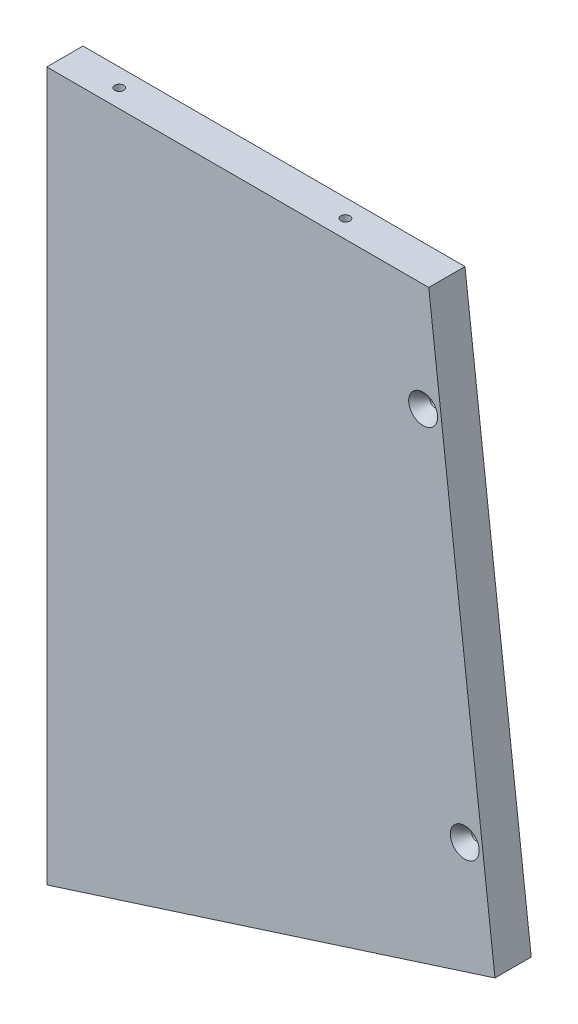
ISO-10303-21;
HEADER;
FILE_DESCRIPTION(('STEP AP214'),'2;1');
FILE_NAME('part.step','',(''),(''),'','','');
FILE_SCHEMA(('AUTOMOTIVE_DESIGN { 1 0 10303 214 1 1 1 1 }'));
ENDSEC;
DATA;
#1=APPLICATION_CONTEXT('core data for automotive mechanical design processes');
#2=APPLICATION_PROTOCOL_DEFINITION('international standard','automotive_design',2000,#1);
#3=PRODUCT_CONTEXT('',#1,'mechanical');
#4=PRODUCT('Part','Part','',(#3));
#5=PRODUCT_RELATED_PRODUCT_CATEGORY('part','',(#4));
#6=PRODUCT_DEFINITION_FORMATION('','',#4);
#7=PRODUCT_DEFINITION_CONTEXT('part definition',#1,'design');
#8=PRODUCT_DEFINITION('design','',#6,#7);
#9=PRODUCT_DEFINITION_SHAPE('','',#8);
#10=(LENGTH_UNIT() NAMED_UNIT(*) SI_UNIT(.MILLI.,.METRE.));
#11=(NAMED_UNIT(*) PLANE_ANGLE_UNIT() SI_UNIT($,.RADIAN.));
#12=(NAMED_UNIT(*) SI_UNIT($,.STERADIAN.) SOLID_ANGLE_UNIT());
#13=UNCERTAINTY_MEASURE_WITH_UNIT(LENGTH_MEASURE(1.E-05),#10,'distance_accuracy_value','');
#14=(GEOMETRIC_REPRESENTATION_CONTEXT(3) GLOBAL_UNCERTAINTY_ASSIGNED_CONTEXT((#13)) GLOBAL_UNIT_ASSIGNED_CONTEXT((#10,
#11,#12)) REPRESENTATION_CONTEXT('',''));
#15=CARTESIAN_POINT('',(0.,0.,0.));
#16=DIRECTION('',(0.,0.,1.));
#17=DIRECTION('',(1.,0.,0.));
#18=AXIS2_PLACEMENT_3D('',#15,#16,#17);
#19=CARTESIAN_POINT('',(-64.9774169834746,-197.96604829264,-12.6999999999997));
#20=DIRECTION('',(0.993195579602869,0.11645832154604,0.));
#21=DIRECTION('',(-0.11645832154604,0.993195579602869,0.));
#22=AXIS2_PLACEMENT_3D('',#19,#20,#21);
#23=PLANE('',#22);
#24=DIRECTION('',(-0.11645832154604,0.993195579602869,0.));
#25=VECTOR('',#24,1.);
#26=CARTESIAN_POINT('',(-64.9774169834746,-197.96604829264,0.));
#27=LINE('',#26,#25);
#28=CARTESIAN_POINT('',(-64.9774169834746,-197.96604829264,0.));
#29=VERTEX_POINT('',#28);
#30=CARTESIAN_POINT('',(-88.1901599524695,0.,-5.82867087928207E-13));
#31=VERTEX_POINT('',#30);
#32=EDGE_CURVE('E157',#29,#31,#27,.T.);
#33=ORIENTED_EDGE('',*,*,#32,.F.);
#34=DIRECTION('',(0.,0.,1.));
#35=VECTOR('',#34,1.);
#36=CARTESIAN_POINT('',(-64.9774169834746,-197.96604829264,-12.6999999999997));
#37=LINE('',#36,#35);
#38=CARTESIAN_POINT('',(-64.9774169834746,-197.96604829264,-12.6999999999997));
#39=VERTEX_POINT('',#38);
#40=EDGE_CURVE('E11',#39,#29,#37,.T.);
#41=ORIENTED_EDGE('',*,*,#40,.F.);
#42=DIRECTION('',(-0.11645832154604,0.993195579602869,0.));
#43=VECTOR('',#42,1.);
#44=CARTESIAN_POINT('',(-64.9774169834746,-197.96604829264,-12.6999999999997));
#45=LINE('',#44,#43);
#46=CARTESIAN_POINT('',(-88.1901599524693,0.,-12.7));
#47=VERTEX_POINT('',#46);
#48=EDGE_CURVE('E148',#39,#47,#45,.T.);
#49=ORIENTED_EDGE('',*,*,#48,.T.);
#50=DIRECTION('',(0.,0.,1.));
#51=VECTOR('',#50,1.);
#52=CARTESIAN_POINT('',(-88.1901599524693,0.,-12.7));
#53=LINE('',#52,#51);
#54=EDGE_CURVE('E80',#47,#31,#53,.T.);
#55=ORIENTED_EDGE('',*,*,#54,.T.);
#56=EDGE_LOOP('',(#33,#41,#49,#55));
#57=FACE_BOUND('',#56,.T.);
#58=ADVANCED_FACE('F36',(#57),#23,.T.);
#59=CARTESIAN_POINT('',(-64.9774169834746,-197.96604829264,-12.6999999999997));
#60=DIRECTION('',(0.304884492171613,-0.952389335531041,0.));
#61=DIRECTION('',(0.952389335531041,0.304884492171613,0.));
#62=AXIS2_PLACEMENT_3D('',#59,#60,#61);
#63=PLANE('',#62);
#64=CARTESIAN_POINT('',(-104.122442077063,-210.497384639502,-6.34999999999961));
#65=DIRECTION('',(0.304884492171613,-0.952389335531041,0.));
#66=DIRECTION('',(0.952389335531041,0.304884492171613,0.));
#67=AXIS2_PLACEMENT_3D('',#64,#65,#66);
#68=CIRCLE('',#67,1.5875);
#69=CARTESIAN_POINT('',(-102.610524006908,-210.013380508179,-6.34999999999961));
#70=VERTEX_POINT('',#69);
#71=EDGE_CURVE('E39',#70,#70,#68,.T.);
#72=ORIENTED_EDGE('',*,*,#71,.F.);
#73=EDGE_LOOP('',(#72));
#74=FACE_BOUND('',#73,.T.);
#75=CARTESIAN_POINT('',(-197.286410666661,-240.321583832464,-6.34999999999961));
#76=DIRECTION('',(0.304884492171613,-0.952389335531041,0.));
#77=DIRECTION('',(0.952389335531041,0.304884492171613,0.));
#78=AXIS2_PLACEMENT_3D('',#75,#76,#77);
#79=CIRCLE('',#78,1.5875);
#80=CARTESIAN_POINT('',(-195.774492596505,-239.837579701141,-6.34999999999961));
#81=VERTEX_POINT('',#80);
#82=EDGE_CURVE('E117',#81,#81,#79,.T.);
#83=ORIENTED_EDGE('',*,*,#82,.F.);
#84=EDGE_LOOP('',(#83));
#85=FACE_BOUND('',#84,.T.);
#86=DIRECTION('',(0.952389335531041,0.304884492171613,0.));
#87=VECTOR('',#86,1.);
#88=CARTESIAN_POINT('',(-64.9774169834746,-197.96604829264,0.));
#89=LINE('',#88,#87);
#90=CARTESIAN_POINT('',(-222.05296718065,-248.249999999995,0.));
#91=VERTEX_POINT('',#90);
#92=EDGE_CURVE('E151',#91,#29,#89,.T.);
#93=ORIENTED_EDGE('',*,*,#92,.F.);
#94=DIRECTION('',(0.,0.,1.));
#95=VECTOR('',#94,1.);
#96=CARTESIAN_POINT('',(-222.05296718065,-248.249999999995,-12.7));
#97=LINE('',#96,#95);
#98=CARTESIAN_POINT('',(-222.05296718065,-248.249999999995,-12.7));
#99=VERTEX_POINT('',#98);
#100=EDGE_CURVE('E45',#99,#91,#97,.T.);
#101=ORIENTED_EDGE('',*,*,#100,.F.);
#102=DIRECTION('',(0.952389335531041,0.304884492171613,0.));
#103=VECTOR('',#102,1.);
#104=CARTESIAN_POINT('',(-64.9774169834746,-197.96604829264,-12.6999999999997));
#105=LINE('',#104,#103);
#106=EDGE_CURVE('E155',#99,#39,#105,.T.);
#107=ORIENTED_EDGE('',*,*,#106,.T.);
#108=ORIENTED_EDGE('',*,*,#40,.T.);
#109=EDGE_LOOP('',(#93,#101,#107,#108));
#110=FACE_BOUND('',#109,.T.);
#111=ADVANCED_FACE('F187',(#74,#85,#110),#63,.T.);
#112=CARTESIAN_POINT('',(-222.05296718065,-248.249999999995,-12.7));
#113=DIRECTION('',(-1.,0.,0.));
#114=DIRECTION('',(0.,-1.,0.));
#115=AXIS2_PLACEMENT_3D('',#112,#113,#114);
#116=PLANE('',#115);
#117=CARTESIAN_POINT('',(-222.05296718065,-210.149999999995,-6.35000000000113));
#118=DIRECTION('',(-1.,0.,0.));
#119=DIRECTION('',(0.,-1.,0.));
#120=AXIS2_PLACEMENT_3D('',#117,#118,#119);
#121=CIRCLE('',#120,1.58749999999999);
#122=CARTESIAN_POINT('',(-222.05296718065,-211.737499999995,-6.35000000000113));
#123=VERTEX_POINT('',#122);
#124=EDGE_CURVE('E143',#123,#123,#121,.T.);
#125=ORIENTED_EDGE('',*,*,#124,.F.);
#126=EDGE_LOOP('',(#125));
#127=FACE_BOUND('',#126,.T.);
#128=CARTESIAN_POINT('',(-222.05296718065,-38.1000000000009,-6.35000000000113));
#129=DIRECTION('',(-1.,0.,0.));
#130=DIRECTION('',(0.,-1.,0.));
#131=AXIS2_PLACEMENT_3D('',#128,#129,#130);
#132=CIRCLE('',#131,1.5875);
#133=CARTESIAN_POINT('',(-222.05296718065,-39.6875000000009,-6.35000000000113));
#134=VERTEX_POINT('',#133);
#135=EDGE_CURVE('E147',#134,#134,#132,.T.);
#136=ORIENTED_EDGE('',*,*,#135,.F.);
#137=EDGE_LOOP('',(#136));
#138=FACE_BOUND('',#137,.T.);
#139=DIRECTION('',(0.,-1.,0.));
#140=VECTOR('',#139,1.);
#141=CARTESIAN_POINT('',(-222.05296718065,-248.249999999995,0.));
#142=LINE('',#141,#140);
#143=CARTESIAN_POINT('',(-222.05296718065,0.,0.));
#144=VERTEX_POINT('',#143);
#145=EDGE_CURVE('E163',#144,#91,#142,.T.);
#146=ORIENTED_EDGE('',*,*,#145,.F.);
#147=DIRECTION('',(0.,0.,1.));
#148=VECTOR('',#147,1.);
#149=CARTESIAN_POINT('',(-222.05296718065,-2.22044604925031E-13,-12.7));
#150=LINE('',#149,#148);
#151=CARTESIAN_POINT('',(-222.05296718065,-2.22044604925031E-13,-12.7));
#152=VERTEX_POINT('',#151);
#153=EDGE_CURVE('E168',#152,#144,#150,.T.);
#154=ORIENTED_EDGE('',*,*,#153,.F.);
#155=DIRECTION('',(0.,-1.,0.));
#156=VECTOR('',#155,1.);
#157=CARTESIAN_POINT('',(-222.05296718065,-248.249999999995,-12.7));
#158=LINE('',#157,#156);
#159=EDGE_CURVE('E153',#152,#99,#158,.T.);
#160=ORIENTED_EDGE('',*,*,#159,.T.);
#161=ORIENTED_EDGE('',*,*,#100,.T.);
#162=EDGE_LOOP('',(#146,#154,#160,#161));
#163=FACE_BOUND('',#162,.T.);
#164=ADVANCED_FACE('F189',(#127,#138,#163),#116,.T.);
#165=CARTESIAN_POINT('',(-88.1901599524693,0.,-12.7));
#166=DIRECTION('',(0.,1.,0.));
#167=DIRECTION('',(-1.,0.,0.));
#168=AXIS2_PLACEMENT_3D('',#165,#166,#167);
#169=PLANE('',#168);
#170=CARTESIAN_POINT('',(-203.00296718065,0.,-6.35000000000011));
#171=DIRECTION('',(0.,1.,0.));
#172=DIRECTION('',(-1.,0.,0.));
#173=AXIS2_PLACEMENT_3D('',#170,#171,#172);
#174=CIRCLE('',#173,1.58749999999999);
#175=CARTESIAN_POINT('',(-204.59046718065,0.,-6.35000000000011));
#176=VERTEX_POINT('',#175);
#177=EDGE_CURVE('E121',#176,#176,#174,.T.);
#178=ORIENTED_EDGE('',*,*,#177,.F.);
#179=EDGE_LOOP('',(#178));
#180=FACE_BOUND('',#179,.T.);
#181=CARTESIAN_POINT('',(-123.747327392619,2.22044604925031E-13,-6.35000000000069));
#182=DIRECTION('',(0.,1.,0.));
#183=DIRECTION('',(-1.,0.,0.));
#184=AXIS2_PLACEMENT_3D('',#181,#182,#183);
#185=CIRCLE('',#184,1.5875);
#186=CARTESIAN_POINT('',(-125.334827392619,2.20458373778598E-13,-6.35000000000069));
#187=VERTEX_POINT('',#186);
#188=EDGE_CURVE('E125',#187,#187,#185,.T.);
#189=ORIENTED_EDGE('',*,*,#188,.F.);
#190=EDGE_LOOP('',(#189));
#191=FACE_BOUND('',#190,.T.);
#192=DIRECTION('',(-1.,0.,0.));
#193=VECTOR('',#192,1.);
#194=CARTESIAN_POINT('',(-88.1901599524695,0.,-5.82867087928207E-13));
#195=LINE('',#194,#193);
#196=EDGE_CURVE('E160',#31,#144,#195,.T.);
#197=ORIENTED_EDGE('',*,*,#196,.F.);
#198=ORIENTED_EDGE('',*,*,#54,.F.);
#199=DIRECTION('',(-1.,0.,0.));
#200=VECTOR('',#199,1.);
#201=CARTESIAN_POINT('',(-88.1901599524693,0.,-12.7));
#202=LINE('',#201,#200);
#203=EDGE_CURVE('E150',#47,#152,#202,.T.);
#204=ORIENTED_EDGE('',*,*,#203,.T.);
#205=ORIENTED_EDGE('',*,*,#153,.T.);
#206=EDGE_LOOP('',(#197,#198,#204,#205));
#207=FACE_BOUND('',#206,.T.);
#208=ADVANCED_FACE('F198',(#180,#191,#207),#169,.T.);
#209=CARTESIAN_POINT('',(0.,0.,-12.7));
#210=DIRECTION('',(0.,0.,1.));
#211=DIRECTION('',(1.,0.,0.));
#212=AXIS2_PLACEMENT_3D('',#209,#210,#211);
#213=PLANE('',#212);
#214=CARTESIAN_POINT('',(-75.5766743950045,-162.097975038985,-12.7));
#215=DIRECTION('',(0.,0.,1.));
#216=DIRECTION('',(1.,0.,0.));
#217=AXIS2_PLACEMENT_3D('',#214,#215,#216);
#218=CIRCLE('',#217,1.5875);
#219=CARTESIAN_POINT('',(-73.9891743950046,-162.097975038985,-12.7));
#220=VERTEX_POINT('',#219);
#221=EDGE_CURVE('E132',#220,#220,#218,.T.);
#222=ORIENTED_EDGE('',*,*,#221,.T.);
#223=EDGE_LOOP('',(#222));
#224=FACE_BOUND('',#223,.T.);
#225=CARTESIAN_POINT('',(-90.1466019911969,-37.8407515828578,-12.7));
#226=DIRECTION('',(0.,0.,1.));
#227=DIRECTION('',(1.,0.,0.));
#228=AXIS2_PLACEMENT_3D('',#225,#226,#227);
#229=CIRCLE('',#228,1.5875);
#230=CARTESIAN_POINT('',(-88.5591019911969,-37.8407515828578,-12.7));
#231=VERTEX_POINT('',#230);
#232=EDGE_CURVE('E139',#231,#231,#229,.T.);
#233=ORIENTED_EDGE('',*,*,#232,.T.);
#234=EDGE_LOOP('',(#233));
#235=FACE_BOUND('',#234,.T.);
#236=ORIENTED_EDGE('',*,*,#48,.F.);
#237=ORIENTED_EDGE('',*,*,#106,.F.);
#238=ORIENTED_EDGE('',*,*,#159,.F.);
#239=ORIENTED_EDGE('',*,*,#203,.F.);
#240=EDGE_LOOP('',(#236,#237,#238,#239));
#241=FACE_BOUND('',#240,.T.);
#242=ADVANCED_FACE('F197',(#224,#235,#241),#213,.F.);
#243=CARTESIAN_POINT('',(0.,0.,0.));
#244=DIRECTION('',(0.,0.,1.));
#245=DIRECTION('',(1.,0.,0.));
#246=AXIS2_PLACEMENT_3D('',#243,#244,#245);
#247=PLANE('',#246);
#248=CARTESIAN_POINT('',(-75.5766743950048,-162.097975038985,4.32986979603811E-12));
#249=DIRECTION('',(0.,0.,1.));
#250=DIRECTION('',(1.,0.,0.));
#251=AXIS2_PLACEMENT_3D('',#248,#249,#250);
#252=CIRCLE('',#251,5.08);
#253=CARTESIAN_POINT('',(-70.4966743950048,-162.097975038985,4.32986979603811E-12));
#254=VERTEX_POINT('',#253);
#255=EDGE_CURVE('E126',#254,#254,#252,.T.);
#256=ORIENTED_EDGE('',*,*,#255,.F.);
#257=EDGE_LOOP('',(#256));
#258=FACE_BOUND('',#257,.T.);
#259=CARTESIAN_POINT('',(-90.1466019911969,-37.8407515828578,4.32986979603811E-12));
#260=DIRECTION('',(0.,0.,1.));
#261=DIRECTION('',(1.,0.,0.));
#262=AXIS2_PLACEMENT_3D('',#259,#260,#261);
#263=CIRCLE('',#262,5.08);
#264=CARTESIAN_POINT('',(-85.0666019911969,-37.8407515828578,4.32986979603811E-12));
#265=VERTEX_POINT('',#264);
#266=EDGE_CURVE('E133',#265,#265,#263,.T.);
#267=ORIENTED_EDGE('',*,*,#266,.F.);
#268=EDGE_LOOP('',(#267));
#269=FACE_BOUND('',#268,.T.);
#270=ORIENTED_EDGE('',*,*,#32,.T.);
#271=ORIENTED_EDGE('',*,*,#196,.T.);
#272=ORIENTED_EDGE('',*,*,#145,.T.);
#273=ORIENTED_EDGE('',*,*,#92,.T.);
#274=EDGE_LOOP('',(#270,#271,#272,#273));
#275=FACE_BOUND('',#274,.T.);
#276=ADVANCED_FACE('F193',(#258,#269,#275),#247,.T.);
#277=CARTESIAN_POINT('',(-203.002967180653,-38.1000000000007,-6.35000000000113));
#278=DIRECTION('',(-1.,0.,0.));
#279=DIRECTION('',(0.,0.,1.));
#280=AXIS2_PLACEMENT_3D('',#277,#278,#279);
#281=CONICAL_SURFACE('',#280,1.5875,1.02974425867666);
#282=CARTESIAN_POINT('',(-202.049100947947,-38.1000000000007,-6.35000000000113));
#283=VERTEX_POINT('',#282);
#284=VERTEX_LOOP('',#283);
#285=FACE_BOUND('',#284,.T.);
#286=CARTESIAN_POINT('',(-203.002967180653,-38.1000000000007,-6.35000000000113));
#287=DIRECTION('',(-1.,0.,0.));
#288=DIRECTION('',(0.,0.,1.));
#289=AXIS2_PLACEMENT_3D('',#286,#287,#288);
#290=CIRCLE('',#289,1.5875);
#291=CARTESIAN_POINT('',(-203.002967180653,-38.1000000000007,-4.76250000000113));
#292=VERTEX_POINT('',#291);
#293=EDGE_CURVE('E144',#292,#292,#290,.T.);
#294=ORIENTED_EDGE('',*,*,#293,.T.);
#295=EDGE_LOOP('',(#294));
#296=FACE_BOUND('',#295,.T.);
#297=ADVANCED_FACE('F242',(#285,#296),#281,.F.);
#298=CARTESIAN_POINT('',(-234.752967180653,-38.1000000000009,-6.35000000000055));
#299=DIRECTION('',(-1.,0.,0.));
#300=DIRECTION('',(0.,0.,1.));
#301=AXIS2_PLACEMENT_3D('',#298,#299,#300);
#302=CYLINDRICAL_SURFACE('',#301,1.5875);
#303=ORIENTED_EDGE('',*,*,#135,.T.);
#304=EDGE_LOOP('',(#303));
#305=FACE_BOUND('',#304,.T.);
#306=ORIENTED_EDGE('',*,*,#293,.F.);
#307=EDGE_LOOP('',(#306));
#308=FACE_BOUND('',#307,.T.);
#309=ADVANCED_FACE('F252',(#305,#308),#302,.F.);
#310=CARTESIAN_POINT('',(-203.002967180653,-210.149999999995,-6.35000000000113));
#311=DIRECTION('',(-1.,0.,0.));
#312=DIRECTION('',(0.,0.,1.));
#313=AXIS2_PLACEMENT_3D('',#310,#311,#312);
#314=CONICAL_SURFACE('',#313,1.58749999999999,1.02974425867666);
#315=CARTESIAN_POINT('',(-202.049100947947,-210.149999999995,-6.35000000000113));
#316=VERTEX_POINT('',#315);
#317=VERTEX_LOOP('',#316);
#318=FACE_BOUND('',#317,.T.);
#319=CARTESIAN_POINT('',(-203.002967180653,-210.149999999995,-6.35000000000113));
#320=DIRECTION('',(-1.,0.,0.));
#321=DIRECTION('',(0.,0.,1.));
#322=AXIS2_PLACEMENT_3D('',#319,#320,#321);
#323=CIRCLE('',#322,1.58749999999999);
#324=CARTESIAN_POINT('',(-203.002967180653,-210.149999999995,-4.76250000000114));
#325=VERTEX_POINT('',#324);
#326=EDGE_CURVE('E140',#325,#325,#323,.T.);
#327=ORIENTED_EDGE('',*,*,#326,.T.);
#328=EDGE_LOOP('',(#327));
#329=FACE_BOUND('',#328,.T.);
#330=ADVANCED_FACE('F262',(#318,#329),#314,.F.);
#331=CARTESIAN_POINT('',(-234.752967180653,-210.149999999995,-6.35000000000113));
#332=DIRECTION('',(-1.,0.,0.));
#333=DIRECTION('',(0.,0.,1.));
#334=AXIS2_PLACEMENT_3D('',#331,#332,#333);
#335=CYLINDRICAL_SURFACE('',#334,1.58749999999999);
#336=ORIENTED_EDGE('',*,*,#124,.T.);
#337=EDGE_LOOP('',(#336));
#338=FACE_BOUND('',#337,.T.);
#339=ORIENTED_EDGE('',*,*,#326,.F.);
#340=EDGE_LOOP('',(#339));
#341=FACE_BOUND('',#340,.T.);
#342=ADVANCED_FACE('F272',(#338,#341),#335,.F.);
#343=CARTESIAN_POINT('',(-90.1466019911969,-37.8407515828578,4.32986979603811E-12));
#344=DIRECTION('',(0.,0.,1.));
#345=DIRECTION('',(1.,0.,0.));
#346=AXIS2_PLACEMENT_3D('',#343,#344,#345);
#347=CYLINDRICAL_SURFACE('',#346,1.5875);
#348=CARTESIAN_POINT('',(-90.1466019911969,-37.8407515828578,-4.01766166221504));
#349=DIRECTION('',(0.,0.,1.));
#350=DIRECTION('',(1.,0.,0.));
#351=AXIS2_PLACEMENT_3D('',#348,#349,#350);
#352=CIRCLE('',#351,1.58749999999999);
#353=CARTESIAN_POINT('',(-88.5591019911969,-37.8407515828578,-4.01766166221504));
#354=VERTEX_POINT('',#353);
#355=EDGE_CURVE('E136',#354,#354,#352,.T.);
#356=ORIENTED_EDGE('',*,*,#355,.T.);
#357=EDGE_LOOP('',(#356));
#358=FACE_BOUND('',#357,.T.);
#359=ORIENTED_EDGE('',*,*,#232,.F.);
#360=EDGE_LOOP('',(#359));
#361=FACE_BOUND('',#360,.T.);
#362=ADVANCED_FACE('F282',(#358,#361),#347,.F.);
#363=CARTESIAN_POINT('',(-90.1466019911969,-37.8407515828578,4.32986979603811E-12));
#364=DIRECTION('',(0.,0.,1.));
#365=DIRECTION('',(1.,0.,0.));
#366=AXIS2_PLACEMENT_3D('',#363,#364,#365);
#367=CONICAL_SURFACE('',#366,5.08,0.715584993317678);
#368=ORIENTED_EDGE('',*,*,#355,.F.);
#369=EDGE_LOOP('',(#368));
#370=FACE_BOUND('',#369,.T.);
#371=ORIENTED_EDGE('',*,*,#266,.T.);
#372=EDGE_LOOP('',(#371));
#373=FACE_BOUND('',#372,.T.);
#374=ADVANCED_FACE('F292',(#370,#373),#367,.F.);
#375=CARTESIAN_POINT('',(-75.5766743950048,-162.097975038985,4.32986979603811E-12));
#376=DIRECTION('',(0.,0.,1.));
#377=DIRECTION('',(1.,0.,0.));
#378=AXIS2_PLACEMENT_3D('',#375,#376,#377);
#379=CYLINDRICAL_SURFACE('',#378,1.5875);
#380=CARTESIAN_POINT('',(-75.5766743950048,-162.097975038985,-4.01766166221504));
#381=DIRECTION('',(0.,0.,1.));
#382=DIRECTION('',(1.,0.,0.));
#383=AXIS2_PLACEMENT_3D('',#380,#381,#382);
#384=CIRCLE('',#383,1.58749999999999);
#385=CARTESIAN_POINT('',(-73.9891743950048,-162.097975038985,-4.01766166221504));
#386=VERTEX_POINT('',#385);
#387=EDGE_CURVE('E129',#386,#386,#384,.T.);
#388=ORIENTED_EDGE('',*,*,#387,.T.);
#389=EDGE_LOOP('',(#388));
#390=FACE_BOUND('',#389,.T.);
#391=ORIENTED_EDGE('',*,*,#221,.F.);
#392=EDGE_LOOP('',(#391));
#393=FACE_BOUND('',#392,.T.);
#394=ADVANCED_FACE('F302',(#390,#393),#379,.F.);
#395=CARTESIAN_POINT('',(-75.5766743950048,-162.097975038985,4.32986979603811E-12));
#396=DIRECTION('',(0.,0.,1.));
#397=DIRECTION('',(1.,0.,0.));
#398=AXIS2_PLACEMENT_3D('',#395,#396,#397);
#399=CONICAL_SURFACE('',#398,5.08,0.715584993317678);
#400=ORIENTED_EDGE('',*,*,#387,.F.);
#401=EDGE_LOOP('',(#400));
#402=FACE_BOUND('',#401,.T.);
#403=ORIENTED_EDGE('',*,*,#255,.T.);
#404=EDGE_LOOP('',(#403));
#405=FACE_BOUND('',#404,.T.);
#406=ADVANCED_FACE('F312',(#402,#405),#399,.F.);
#407=CARTESIAN_POINT('',(-123.747327392619,-19.0499999999989,-6.35000000000011));
#408=DIRECTION('',(0.,1.,0.));
#409=DIRECTION('',(0.,0.,1.));
#410=AXIS2_PLACEMENT_3D('',#407,#408,#409);
#411=CONICAL_SURFACE('',#410,1.58750000000001,1.02974425867666);
#412=CARTESIAN_POINT('',(-123.747327392619,-20.0038662327053,-6.35000000000011));
#413=VERTEX_POINT('',#412);
#414=VERTEX_LOOP('',#413);
#415=FACE_BOUND('',#414,.T.);
#416=CARTESIAN_POINT('',(-123.747327392619,-19.0499999999989,-6.35000000000011));
#417=DIRECTION('',(0.,1.,0.));
#418=DIRECTION('',(0.,0.,1.));
#419=AXIS2_PLACEMENT_3D('',#416,#417,#418);
#420=CIRCLE('',#419,1.58750000000001);
#421=CARTESIAN_POINT('',(-123.747327392619,-19.0499999999989,-4.7625000000001));
#422=VERTEX_POINT('',#421);
#423=EDGE_CURVE('E122',#422,#422,#420,.T.);
#424=ORIENTED_EDGE('',*,*,#423,.T.);
#425=EDGE_LOOP('',(#424));
#426=FACE_BOUND('',#425,.T.);
#427=ADVANCED_FACE('F322',(#415,#426),#411,.F.);
#428=CARTESIAN_POINT('',(-123.747327392619,12.7000000000008,-6.34999999999952));
#429=DIRECTION('',(0.,1.,0.));
#430=DIRECTION('',(0.,0.,1.));
#431=AXIS2_PLACEMENT_3D('',#428,#429,#430);
#432=CYLINDRICAL_SURFACE('',#431,1.5875);
#433=ORIENTED_EDGE('',*,*,#188,.T.);
#434=EDGE_LOOP('',(#433));
#435=FACE_BOUND('',#434,.T.);
#436=ORIENTED_EDGE('',*,*,#423,.F.);
#437=EDGE_LOOP('',(#436));
#438=FACE_BOUND('',#437,.T.);
#439=ADVANCED_FACE('F332',(#435,#438),#432,.F.);
#440=CARTESIAN_POINT('',(-203.00296718065,-19.0499999999989,-6.34999999999952));
#441=DIRECTION('',(0.,1.,0.));
#442=DIRECTION('',(0.,0.,1.));
#443=AXIS2_PLACEMENT_3D('',#440,#441,#442);
#444=CONICAL_SURFACE('',#443,1.58749999999999,1.02974425867665);
#445=CARTESIAN_POINT('',(-203.00296718065,-20.0038662327053,-6.34999999999952));
#446=VERTEX_POINT('',#445);
#447=VERTEX_LOOP('',#446);
#448=FACE_BOUND('',#447,.T.);
#449=CARTESIAN_POINT('',(-203.00296718065,-19.0499999999989,-6.34999999999952));
#450=DIRECTION('',(0.,1.,0.));
#451=DIRECTION('',(0.,0.,1.));
#452=AXIS2_PLACEMENT_3D('',#449,#450,#451);
#453=CIRCLE('',#452,1.58749999999999);
#454=CARTESIAN_POINT('',(-203.00296718065,-19.0499999999989,-4.76249999999953));
#455=VERTEX_POINT('',#454);
#456=EDGE_CURVE('E118',#455,#455,#453,.T.);
#457=ORIENTED_EDGE('',*,*,#456,.T.);
#458=EDGE_LOOP('',(#457));
#459=FACE_BOUND('',#458,.T.);
#460=ADVANCED_FACE('F342',(#448,#459),#444,.F.);
#461=CARTESIAN_POINT('',(-203.00296718065,12.7000000000008,-6.35000000000069));
#462=DIRECTION('',(0.,1.,0.));
#463=DIRECTION('',(0.,0.,1.));
#464=AXIS2_PLACEMENT_3D('',#461,#462,#463);
#465=CYLINDRICAL_SURFACE('',#464,1.58749999999999);
#466=ORIENTED_EDGE('',*,*,#177,.T.);
#467=EDGE_LOOP('',(#466));
#468=FACE_BOUND('',#467,.T.);
#469=ORIENTED_EDGE('',*,*,#456,.F.);
#470=EDGE_LOOP('',(#469));
#471=FACE_BOUND('',#470,.T.);
#472=ADVANCED_FACE('F352',(#468,#471),#465,.F.);
#473=CARTESIAN_POINT('',(-203.09446024252,-222.178566990631,-6.35000000000019));
#474=DIRECTION('',(0.304884492171613,-0.952389335531041,0.));
#475=DIRECTION('',(0.952389335531041,0.304884492171613,0.));
#476=AXIS2_PLACEMENT_3D('',#473,#474,#475);
#477=CONICAL_SURFACE('',#476,1.5875,1.02974425867666);
#478=CARTESIAN_POINT('',(-203.385279264478,-221.270114963078,-6.35000000000019));
#479=VERTEX_POINT('',#478);
#480=VERTEX_LOOP('',#479);
#481=FACE_BOUND('',#480,.T.);
#482=CARTESIAN_POINT('',(-203.09446024252,-222.178566990631,-6.35000000000019));
#483=DIRECTION('',(0.304884492171613,-0.952389335531041,0.));
#484=DIRECTION('',(0.952389335531041,0.304884492171613,0.));
#485=AXIS2_PLACEMENT_3D('',#482,#483,#484);
#486=CIRCLE('',#485,1.5875);
#487=CARTESIAN_POINT('',(-201.582542172364,-221.694562859308,-6.35000000000019));
#488=VERTEX_POINT('',#487);
#489=EDGE_CURVE('E113',#488,#488,#486,.T.);
#490=ORIENTED_EDGE('',*,*,#489,.T.);
#491=EDGE_LOOP('',(#490));
#492=FACE_BOUND('',#491,.T.);
#493=ADVANCED_FACE('F362',(#481,#492),#477,.F.);
#494=CARTESIAN_POINT('',(-193.414377616071,-252.416928393741,-6.34999999999961));
#495=DIRECTION('',(0.304884492171613,-0.952389335531041,0.));
#496=DIRECTION('',(0.952389335531041,0.304884492171613,0.));
#497=AXIS2_PLACEMENT_3D('',#494,#495,#496);
#498=CYLINDRICAL_SURFACE('',#497,1.5875);
#499=ORIENTED_EDGE('',*,*,#82,.T.);
#500=EDGE_LOOP('',(#499));
#501=FACE_BOUND('',#500,.T.);
#502=ORIENTED_EDGE('',*,*,#489,.F.);
#503=EDGE_LOOP('',(#502));
#504=FACE_BOUND('',#503,.T.);
#505=ADVANCED_FACE('F105',(#501,#504),#498,.F.);
#506=CARTESIAN_POINT('',(-109.930491652922,-192.354367797668,-6.34999999999961));
#507=DIRECTION('',(0.304884492171613,-0.952389335531041,0.));
#508=DIRECTION('',(0.952389335531041,0.304884492171613,0.));
#509=AXIS2_PLACEMENT_3D('',#506,#507,#508);
#510=CONICAL_SURFACE('',#509,1.5875,1.02974425867665);
#511=CARTESIAN_POINT('',(-110.22131067488,-191.445915770115,-6.34999999999961));
#512=VERTEX_POINT('',#511);
#513=VERTEX_LOOP('',#512);
#514=FACE_BOUND('',#513,.T.);
#515=CARTESIAN_POINT('',(-109.930491652922,-192.354367797668,-6.34999999999961));
#516=DIRECTION('',(0.304884492171613,-0.952389335531041,0.));
#517=DIRECTION('',(0.952389335531041,0.304884492171613,0.));
#518=AXIS2_PLACEMENT_3D('',#515,#516,#517);
#519=CIRCLE('',#518,1.5875);
#520=CARTESIAN_POINT('',(-108.418573582767,-191.870363666345,-6.34999999999961));
#521=VERTEX_POINT('',#520);
#522=EDGE_CURVE('E109',#521,#521,#519,.T.);
#523=ORIENTED_EDGE('',*,*,#522,.T.);
#524=EDGE_LOOP('',(#523));
#525=FACE_BOUND('',#524,.T.);
#526=ADVANCED_FACE('F101',(#514,#525),#510,.F.);
#527=CARTESIAN_POINT('',(-100.250409026473,-222.592729200778,-6.34999999999961));
#528=DIRECTION('',(0.304884492171613,-0.952389335531041,0.));
#529=DIRECTION('',(0.952389335531041,0.304884492171613,0.));
#530=AXIS2_PLACEMENT_3D('',#527,#528,#529);
#531=CYLINDRICAL_SURFACE('',#530,1.5875);
#532=ORIENTED_EDGE('',*,*,#71,.T.);
#533=EDGE_LOOP('',(#532));
#534=FACE_BOUND('',#533,.T.);
#535=ORIENTED_EDGE('',*,*,#522,.F.);
#536=EDGE_LOOP('',(#535));
#537=FACE_BOUND('',#536,.T.);
#538=ADVANCED_FACE('F104',(#534,#537),#531,.F.);
#539=CLOSED_SHELL('',(#58,#111,#164,#208,#242,#276,#297,#309,#330,#342,#362,#374,#394,#406,#427,
#439,#460,#472,#493,#505,#526,#538));
#540=MANIFOLD_SOLID_BREP('B2',#539);
#541=ADVANCED_BREP_SHAPE_REPRESENTATION('',(#18,#540),#14);
#542=SHAPE_DEFINITION_REPRESENTATION(#9,#541);
ENDSEC;
END-ISO-10303-21;
